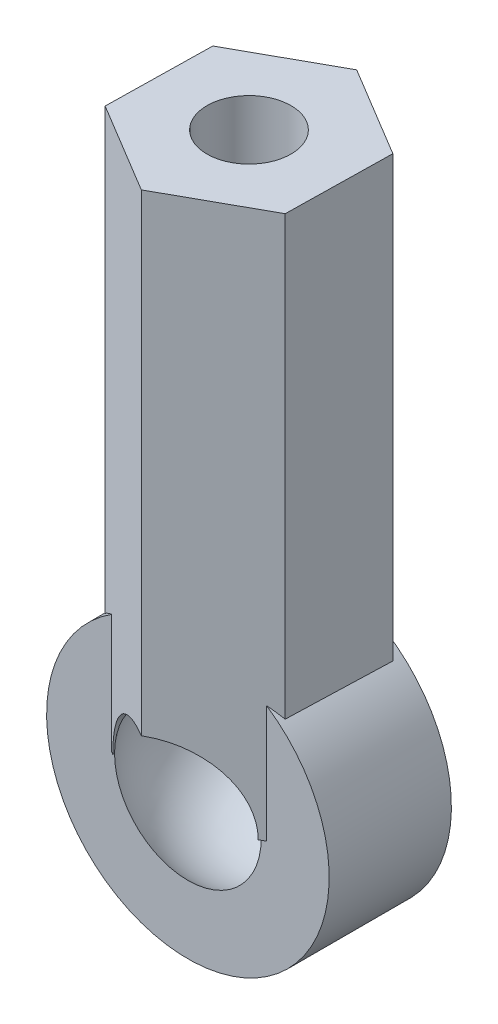
ISO-10303-21;
HEADER;
FILE_DESCRIPTION(('STEP AP214'),'2;1');
FILE_NAME('part.step','',(''),(''),'','','');
FILE_SCHEMA(('AUTOMOTIVE_DESIGN { 1 0 10303 214 1 1 1 1 }'));
ENDSEC;
DATA;
#1=APPLICATION_CONTEXT('core data for automotive mechanical design processes');
#2=APPLICATION_PROTOCOL_DEFINITION('international standard','automotive_design',2000,#1);
#3=PRODUCT_CONTEXT('',#1,'mechanical');
#4=PRODUCT('Part','Part','',(#3));
#5=PRODUCT_RELATED_PRODUCT_CATEGORY('part','',(#4));
#6=PRODUCT_DEFINITION_FORMATION('','',#4);
#7=PRODUCT_DEFINITION_CONTEXT('part definition',#1,'design');
#8=PRODUCT_DEFINITION('design','',#6,#7);
#9=PRODUCT_DEFINITION_SHAPE('','',#8);
#10=(LENGTH_UNIT() NAMED_UNIT(*) SI_UNIT(.MILLI.,.METRE.));
#11=(NAMED_UNIT(*) PLANE_ANGLE_UNIT() SI_UNIT($,.RADIAN.));
#12=(NAMED_UNIT(*) SI_UNIT($,.STERADIAN.) SOLID_ANGLE_UNIT());
#13=UNCERTAINTY_MEASURE_WITH_UNIT(LENGTH_MEASURE(1.E-05),#10,'distance_accuracy_value','');
#14=(GEOMETRIC_REPRESENTATION_CONTEXT(3) GLOBAL_UNCERTAINTY_ASSIGNED_CONTEXT((#13)) GLOBAL_UNIT_ASSIGNED_CONTEXT((#10,
#11,#12)) REPRESENTATION_CONTEXT('',''));
#15=CARTESIAN_POINT('',(0.,0.,0.));
#16=DIRECTION('',(0.,0.,1.));
#17=DIRECTION('',(1.,0.,0.));
#18=AXIS2_PLACEMENT_3D('',#15,#16,#17);
#19=CARTESIAN_POINT('',(0.,0.,0.));
#20=DIRECTION('',(0.,1.,0.));
#21=DIRECTION('',(0.,0.,1.));
#22=AXIS2_PLACEMENT_3D('',#19,#20,#21);
#23=PLANE('',#22);
#24=DIRECTION('',(-0.874675185978453,0.,0.48470952026297));
#25=VECTOR('',#24,1.);
#26=CARTESIAN_POINT('',(0.0486826411564219,0.,-2.77085365915453));
#27=LINE('',#26,#25);
#28=CARTESIAN_POINT('',(-1.92093727122985,0.,-1.67937017118387));
#29=VERTEX_POINT('',#28);
#30=CARTESIAN_POINT('',(-2.06416350537464,0.,-1.6));
#31=VERTEX_POINT('',#30);
#32=EDGE_CURVE('E246',#29,#31,#27,.T.);
#33=ORIENTED_EDGE('',*,*,#32,.F.);
#34=DIRECTION('',(0.,0.,-1.));
#35=VECTOR('',#34,1.);
#36=CARTESIAN_POINT('',(-1.92093727122985,0.,2.77085365915453));
#37=LINE('',#36,#35);
#38=CARTESIAN_POINT('',(-1.92093727122985,0.,-1.6));
#39=VERTEX_POINT('',#38);
#40=EDGE_CURVE('E273',#29,#39,#37,.F.);
#41=ORIENTED_EDGE('',*,*,#40,.T.);
#42=DIRECTION('',(-1.,0.,0.));
#43=VECTOR('',#42,1.);
#44=CARTESIAN_POINT('',(0.,0.,-1.6));
#45=LINE('',#44,#43);
#46=EDGE_CURVE('E171',#39,#31,#45,.T.);
#47=ORIENTED_EDGE('',*,*,#46,.T.);
#48=EDGE_LOOP('',(#33,#41,#47));
#49=FACE_BOUND('',#48,.T.);
#50=ADVANCED_FACE('F33',(#49),#23,.F.);
#51=CARTESIAN_POINT('',(1.99680530381448,0.,-1.6));
#52=VERTEX_POINT('',#51);
#53=CARTESIAN_POINT('',(1.92093727122985,0.,-1.6));
#54=VERTEX_POINT('',#53);
#55=EDGE_CURVE('E172',#52,#54,#45,.T.);
#56=ORIENTED_EDGE('',*,*,#55,.T.);
#57=DIRECTION('',(0.,0.,-1.));
#58=VECTOR('',#57,1.);
#59=CARTESIAN_POINT('',(1.92093727122985,0.,2.77085365915453));
#60=LINE('',#59,#58);
#61=CARTESIAN_POINT('',(1.92093727122985,0.,-1.6455979314174));
#62=VERTEX_POINT('',#61);
#63=EDGE_CURVE('E47',#54,#62,#60,.T.);
#64=ORIENTED_EDGE('',*,*,#63,.T.);
#65=DIRECTION('',(-0.857108350993127,0.,-0.515136170985733));
#66=VECTOR('',#65,1.);
#67=CARTESIAN_POINT('',(2.4239709795751,0.,-1.34326642561248));
#68=LINE('',#67,#66);
#69=EDGE_CURVE('E248',#52,#62,#68,.T.);
#70=ORIENTED_EDGE('',*,*,#69,.F.);
#71=EDGE_LOOP('',(#56,#64,#70));
#72=FACE_BOUND('',#71,.T.);
#73=ADVANCED_FACE('F297',(#72),#23,.F.);
#74=CARTESIAN_POINT('',(2.4239709795751,14.3,-1.34326642561248));
#75=DIRECTION('',(-0.515136170985733,0.,0.857108350993127));
#76=DIRECTION('',(0.857108350993127,0.,0.515136170985733));
#77=AXIS2_PLACEMENT_3D('',#74,#75,#76);
#78=PLANE('',#77);
#79=ORIENTED_EDGE('',*,*,#69,.T.);
#80=CARTESIAN_POINT('',(0.,0.,-2.80011272462709));
#81=DIRECTION('',(-0.515136170985733,0.,0.857108350993127));
#82=DIRECTION('',(-0.857108350993127,0.,-0.515136170985733));
#83=AXIS2_PLACEMENT_3D('',#80,#81,#82);
#84=ELLIPSE('',#83,2.24118370682548,1.92093727122985);
#85=CARTESIAN_POINT('',(0.0486826411564219,1.92032028590286,-2.77085365915453));
#86=VERTEX_POINT('',#85);
#87=EDGE_CURVE('E265',#62,#86,#84,.T.);
#88=ORIENTED_EDGE('',*,*,#87,.T.);
#89=DIRECTION('',(0.,-1.,0.));
#90=VECTOR('',#89,1.);
#91=CARTESIAN_POINT('',(0.0486826411564219,14.3,-2.77085365915453));
#92=LINE('',#91,#90);
#93=CARTESIAN_POINT('',(0.0486826411564219,14.3,-2.77085365915453));
#94=VERTEX_POINT('',#93);
#95=EDGE_CURVE('E168',#94,#86,#92,.T.);
#96=ORIENTED_EDGE('',*,*,#95,.F.);
#97=DIRECTION('',(-0.857108350993127,0.,-0.515136170985733));
#98=VECTOR('',#97,1.);
#99=CARTESIAN_POINT('',(2.4239709795751,14.3,-1.34326642561248));
#100=LINE('',#99,#98);
#101=CARTESIAN_POINT('',(2.4239709795751,14.3,-1.34326642561248));
#102=VERTEX_POINT('',#101);
#103=EDGE_CURVE('E240',#102,#94,#100,.T.);
#104=ORIENTED_EDGE('',*,*,#103,.F.);
#105=DIRECTION('',(0.,-1.,0.));
#106=VECTOR('',#105,1.);
#107=CARTESIAN_POINT('',(2.4239709795751,14.3,-1.34326642561248));
#108=LINE('',#107,#106);
#109=CARTESIAN_POINT('',(2.4239709795751,2.79541851789276,-1.34326642561248));
#110=VERTEX_POINT('',#109);
#111=EDGE_CURVE('E162',#102,#110,#108,.T.);
#112=ORIENTED_EDGE('',*,*,#111,.T.);
#113=CARTESIAN_POINT('',(0.,0.,-2.80011272462709));
#114=DIRECTION('',(-0.515136170985733,0.,0.857108350993127));
#115=DIRECTION('',(0.857108350993127,0.,0.515136170985733));
#116=AXIS2_PLACEMENT_3D('',#113,#114,#115);
#117=ELLIPSE('',#116,4.31684045046677,3.7);
#118=CARTESIAN_POINT('',(1.99680530381448,3.11492673728586,-1.6));
#119=VERTEX_POINT('',#118);
#120=EDGE_CURVE('E184',#119,#110,#117,.F.);
#121=ORIENTED_EDGE('',*,*,#120,.F.);
#122=DIRECTION('',(0.,-1.,0.));
#123=VECTOR('',#122,1.);
#124=CARTESIAN_POINT('',(1.99680530381448,0.,-1.6));
#125=LINE('',#124,#123);
#126=EDGE_CURVE('E205',#119,#52,#125,.T.);
#127=ORIENTED_EDGE('',*,*,#126,.T.);
#128=EDGE_LOOP('',(#79,#88,#96,#104,#112,#121,#127));
#129=FACE_BOUND('',#128,.T.);
#130=ADVANCED_FACE('F236',(#129),#78,.F.);
#131=CARTESIAN_POINT('',(0.0486826411564219,14.3,-2.77085365915453));
#132=DIRECTION('',(0.48470952026297,0.,0.874675185978453));
#133=DIRECTION('',(0.874675185978453,0.,-0.48470952026297));
#134=AXIS2_PLACEMENT_3D('',#131,#132,#133);
#135=PLANE('',#134);
#136=ORIENTED_EDGE('',*,*,#95,.T.);
#137=CARTESIAN_POINT('',(0.,0.,-2.74387571349157));
#138=DIRECTION('',(0.48470952026297,0.,0.874675185978453));
#139=DIRECTION('',(0.874675185978453,0.,-0.48470952026297));
#140=AXIS2_PLACEMENT_3D('',#137,#138,#139);
#141=ELLIPSE('',#140,2.19617213569515,1.92093727122985);
#142=EDGE_CURVE('E270',#86,#29,#141,.T.);
#143=ORIENTED_EDGE('',*,*,#142,.T.);
#144=ORIENTED_EDGE('',*,*,#32,.T.);
#145=DIRECTION('',(0.,1.,0.));
#146=VECTOR('',#145,1.);
#147=CARTESIAN_POINT('',(-2.06416350537464,0.,-1.6));
#148=LINE('',#147,#146);
#149=CARTESIAN_POINT('',(-2.06416350537464,3.07070497167661,-1.6));
#150=VERTEX_POINT('',#149);
#151=EDGE_CURVE('E203',#31,#150,#148,.T.);
#152=ORIENTED_EDGE('',*,*,#151,.T.);
#153=CARTESIAN_POINT('',(0.,0.,-2.74387571349157));
#154=DIRECTION('',(0.48470952026297,0.,0.874675185978453));
#155=DIRECTION('',(-0.874675185978453,0.,0.48470952026297));
#156=AXIS2_PLACEMENT_3D('',#153,#154,#155);
#157=ELLIPSE('',#156,4.23014172496617,3.7);
#158=CARTESIAN_POINT('',(-2.37528833841868,2.83690065200956,-1.42758723354205));
#159=VERTEX_POINT('',#158);
#160=EDGE_CURVE('E181',#159,#150,#157,.F.);
#161=ORIENTED_EDGE('',*,*,#160,.F.);
#162=DIRECTION('',(0.,-1.,0.));
#163=VECTOR('',#162,1.);
#164=CARTESIAN_POINT('',(-2.37528833841868,14.3,-1.42758723354205));
#165=LINE('',#164,#163);
#166=CARTESIAN_POINT('',(-2.37528833841868,14.3,-1.42758723354205));
#167=VERTEX_POINT('',#166);
#168=EDGE_CURVE('E159',#167,#159,#165,.T.);
#169=ORIENTED_EDGE('',*,*,#168,.F.);
#170=DIRECTION('',(-0.874675185978453,0.,0.48470952026297));
#171=VECTOR('',#170,1.);
#172=CARTESIAN_POINT('',(0.0486826411564219,14.3,-2.77085365915453));
#173=LINE('',#172,#171);
#174=EDGE_CURVE('E256',#94,#167,#173,.T.);
#175=ORIENTED_EDGE('',*,*,#174,.F.);
#176=EDGE_LOOP('',(#136,#143,#144,#152,#161,#169,#175));
#177=FACE_BOUND('',#176,.T.);
#178=ADVANCED_FACE('F286',(#177),#135,.F.);
#179=CARTESIAN_POINT('',(-2.4239709795751,14.3,1.34326642561248));
#180=DIRECTION('',(0.515136170985733,0.,-0.857108350993127));
#181=DIRECTION('',(-0.857108350993127,0.,-0.515136170985733));
#182=AXIS2_PLACEMENT_3D('',#179,#180,#181);
#183=PLANE('',#182);
#184=DIRECTION('',(0.857108350993127,0.,0.515136170985733));
#185=VECTOR('',#184,1.);
#186=CARTESIAN_POINT('',(-2.4239709795751,0.,1.34326642561248));
#187=LINE('',#186,#185);
#188=CARTESIAN_POINT('',(-1.99680530381448,0.,1.6));
#189=VERTEX_POINT('',#188);
#190=CARTESIAN_POINT('',(-1.92093727122985,0.,1.6455979314174));
#191=VERTEX_POINT('',#190);
#192=EDGE_CURVE('E150',#189,#191,#187,.T.);
#193=ORIENTED_EDGE('',*,*,#192,.T.);
#194=CARTESIAN_POINT('',(0.,0.,2.80011272462709));
#195=DIRECTION('',(0.515136170985733,0.,-0.857108350993127));
#196=DIRECTION('',(-0.857108350993127,0.,-0.515136170985733));
#197=AXIS2_PLACEMENT_3D('',#194,#195,#196);
#198=ELLIPSE('',#197,2.24118370682548,1.92093727122985);
#199=CARTESIAN_POINT('',(-0.048682641156421,1.92032028590286,2.77085365915453));
#200=VERTEX_POINT('',#199);
#201=EDGE_CURVE('E134',#191,#200,#198,.T.);
#202=ORIENTED_EDGE('',*,*,#201,.T.);
#203=DIRECTION('',(0.,-1.,0.));
#204=VECTOR('',#203,1.);
#205=CARTESIAN_POINT('',(-0.048682641156421,14.3,2.77085365915453));
#206=LINE('',#205,#204);
#207=CARTESIAN_POINT('',(-0.048682641156421,14.3,2.77085365915453));
#208=VERTEX_POINT('',#207);
#209=EDGE_CURVE('E146',#208,#200,#206,.T.);
#210=ORIENTED_EDGE('',*,*,#209,.F.);
#211=DIRECTION('',(0.857108350993127,0.,0.515136170985733));
#212=VECTOR('',#211,1.);
#213=CARTESIAN_POINT('',(-2.4239709795751,14.3,1.34326642561248));
#214=LINE('',#213,#212);
#215=CARTESIAN_POINT('',(-2.4239709795751,14.3,1.34326642561248));
#216=VERTEX_POINT('',#215);
#217=EDGE_CURVE('E252',#216,#208,#214,.T.);
#218=ORIENTED_EDGE('',*,*,#217,.F.);
#219=DIRECTION('',(0.,-1.,0.));
#220=VECTOR('',#219,1.);
#221=CARTESIAN_POINT('',(-2.4239709795751,14.3,1.34326642561248));
#222=LINE('',#221,#220);
#223=CARTESIAN_POINT('',(-2.4239709795751,2.79541851789276,1.34326642561248));
#224=VERTEX_POINT('',#223);
#225=EDGE_CURVE('E155',#216,#224,#222,.T.);
#226=ORIENTED_EDGE('',*,*,#225,.T.);
#227=CARTESIAN_POINT('',(0.,0.,2.80011272462709));
#228=DIRECTION('',(0.515136170985733,0.,-0.857108350993127));
#229=DIRECTION('',(0.857108350993127,0.,0.515136170985733));
#230=AXIS2_PLACEMENT_3D('',#227,#228,#229);
#231=ELLIPSE('',#230,4.31684045046677,3.7);
#232=CARTESIAN_POINT('',(-1.99680530381448,3.11492673728586,1.6));
#233=VERTEX_POINT('',#232);
#234=EDGE_CURVE('E178',#233,#224,#231,.F.);
#235=ORIENTED_EDGE('',*,*,#234,.F.);
#236=DIRECTION('',(0.,1.,0.));
#237=VECTOR('',#236,1.);
#238=CARTESIAN_POINT('',(-1.99680530381448,0.,1.6));
#239=LINE('',#238,#237);
#240=EDGE_CURVE('E200',#189,#233,#239,.T.);
#241=ORIENTED_EDGE('',*,*,#240,.F.);
#242=EDGE_LOOP('',(#193,#202,#210,#218,#226,#235,#241));
#243=FACE_BOUND('',#242,.T.);
#244=ADVANCED_FACE('F144',(#243),#183,.F.);
#245=CARTESIAN_POINT('',(-0.048682641156421,14.3,2.77085365915453));
#246=DIRECTION('',(-0.48470952026297,0.,-0.874675185978453));
#247=DIRECTION('',(-0.874675185978453,0.,0.48470952026297));
#248=AXIS2_PLACEMENT_3D('',#245,#246,#247);
#249=PLANE('',#248);
#250=ORIENTED_EDGE('',*,*,#209,.T.);
#251=CARTESIAN_POINT('',(0.,0.,2.74387571349157));
#252=DIRECTION('',(-0.48470952026297,0.,-0.874675185978453));
#253=DIRECTION('',(0.874675185978453,0.,-0.48470952026297));
#254=AXIS2_PLACEMENT_3D('',#251,#252,#253);
#255=ELLIPSE('',#254,2.19617213569515,1.92093727122985);
#256=CARTESIAN_POINT('',(1.92093727122985,0.,1.67937017118387));
#257=VERTEX_POINT('',#256);
#258=EDGE_CURVE('E131',#200,#257,#255,.T.);
#259=ORIENTED_EDGE('',*,*,#258,.T.);
#260=DIRECTION('',(0.874675185978453,0.,-0.48470952026297));
#261=VECTOR('',#260,1.);
#262=CARTESIAN_POINT('',(-0.048682641156421,0.,2.77085365915453));
#263=LINE('',#262,#261);
#264=CARTESIAN_POINT('',(2.06416350537465,0.,1.6));
#265=VERTEX_POINT('',#264);
#266=EDGE_CURVE('E220',#257,#265,#263,.T.);
#267=ORIENTED_EDGE('',*,*,#266,.T.);
#268=DIRECTION('',(0.,-1.,0.));
#269=VECTOR('',#268,1.);
#270=CARTESIAN_POINT('',(2.06416350537465,0.,1.6));
#271=LINE('',#270,#269);
#272=CARTESIAN_POINT('',(2.06416350537465,3.07070497167661,1.6));
#273=VERTEX_POINT('',#272);
#274=EDGE_CURVE('E197',#273,#265,#271,.T.);
#275=ORIENTED_EDGE('',*,*,#274,.F.);
#276=CARTESIAN_POINT('',(0.,0.,2.74387571349157));
#277=DIRECTION('',(-0.48470952026297,0.,-0.874675185978453));
#278=DIRECTION('',(-0.874675185978453,0.,0.48470952026297));
#279=AXIS2_PLACEMENT_3D('',#276,#277,#278);
#280=ELLIPSE('',#279,4.23014172496617,3.7);
#281=CARTESIAN_POINT('',(2.37528833841868,2.83690065200956,1.42758723354205));
#282=VERTEX_POINT('',#281);
#283=EDGE_CURVE('E175',#282,#273,#280,.F.);
#284=ORIENTED_EDGE('',*,*,#283,.F.);
#285=DIRECTION('',(0.,-1.,0.));
#286=VECTOR('',#285,1.);
#287=CARTESIAN_POINT('',(2.37528833841868,14.3,1.42758723354205));
#288=LINE('',#287,#286);
#289=CARTESIAN_POINT('',(2.37528833841868,14.3,1.42758723354205));
#290=VERTEX_POINT('',#289);
#291=EDGE_CURVE('E156',#290,#282,#288,.T.);
#292=ORIENTED_EDGE('',*,*,#291,.F.);
#293=DIRECTION('',(0.874675185978453,0.,-0.48470952026297));
#294=VECTOR('',#293,1.);
#295=CARTESIAN_POINT('',(-0.048682641156421,14.3,2.77085365915453));
#296=LINE('',#295,#294);
#297=EDGE_CURVE('E154',#208,#290,#296,.T.);
#298=ORIENTED_EDGE('',*,*,#297,.F.);
#299=EDGE_LOOP('',(#250,#259,#267,#275,#284,#292,#298));
#300=FACE_BOUND('',#299,.T.);
#301=ADVANCED_FACE('F152',(#300),#249,.F.);
#302=DIRECTION('',(-1.,0.,0.));
#303=VECTOR('',#302,1.);
#304=CARTESIAN_POINT('',(0.,0.,1.6));
#305=LINE('',#304,#303);
#306=CARTESIAN_POINT('',(-1.92093727122985,0.,1.6));
#307=VERTEX_POINT('',#306);
#308=EDGE_CURVE('E193',#307,#189,#305,.T.);
#309=ORIENTED_EDGE('',*,*,#308,.F.);
#310=DIRECTION('',(0.,0.,-1.));
#311=VECTOR('',#310,1.);
#312=CARTESIAN_POINT('',(-1.92093727122985,0.,2.77085365915453));
#313=LINE('',#312,#311);
#314=EDGE_CURVE('E55',#307,#191,#313,.F.);
#315=ORIENTED_EDGE('',*,*,#314,.T.);
#316=ORIENTED_EDGE('',*,*,#192,.F.);
#317=EDGE_LOOP('',(#309,#315,#316));
#318=FACE_BOUND('',#317,.T.);
#319=ADVANCED_FACE('F278',(#318),#23,.F.);
#320=ORIENTED_EDGE('',*,*,#266,.F.);
#321=DIRECTION('',(0.,0.,-1.));
#322=VECTOR('',#321,1.);
#323=CARTESIAN_POINT('',(1.92093727122985,0.,2.77085365915453));
#324=LINE('',#323,#322);
#325=CARTESIAN_POINT('',(1.92093727122985,0.,1.6));
#326=VERTEX_POINT('',#325);
#327=EDGE_CURVE('E136',#257,#326,#324,.T.);
#328=ORIENTED_EDGE('',*,*,#327,.T.);
#329=EDGE_CURVE('E194',#265,#326,#305,.T.);
#330=ORIENTED_EDGE('',*,*,#329,.F.);
#331=EDGE_LOOP('',(#320,#328,#330));
#332=FACE_BOUND('',#331,.T.);
#333=ADVANCED_FACE('F219',(#332),#23,.F.);
#334=CARTESIAN_POINT('',(0.,0.,-1.6));
#335=DIRECTION('',(0.,0.,1.));
#336=DIRECTION('',(1.,0.,0.));
#337=AXIS2_PLACEMENT_3D('',#334,#335,#336);
#338=PLANE('',#337);
#339=CARTESIAN_POINT('',(0.,0.,-1.6));
#340=DIRECTION('',(0.,0.,1.));
#341=DIRECTION('',(1.,0.,0.));
#342=AXIS2_PLACEMENT_3D('',#339,#340,#341);
#343=CIRCLE('',#342,1.92093727122985);
#344=EDGE_CURVE('E249',#54,#39,#343,.F.);
#345=ORIENTED_EDGE('',*,*,#344,.F.);
#346=ORIENTED_EDGE('',*,*,#55,.F.);
#347=ORIENTED_EDGE('',*,*,#126,.F.);
#348=CARTESIAN_POINT('',(0.,0.,-1.6));
#349=DIRECTION('',(0.,0.,1.));
#350=DIRECTION('',(1.,0.,0.));
#351=AXIS2_PLACEMENT_3D('',#348,#349,#350);
#352=CIRCLE('',#351,3.7);
#353=EDGE_CURVE('E190',#150,#119,#352,.T.);
#354=ORIENTED_EDGE('',*,*,#353,.F.);
#355=ORIENTED_EDGE('',*,*,#151,.F.);
#356=ORIENTED_EDGE('',*,*,#46,.F.);
#357=EDGE_LOOP('',(#345,#346,#347,#354,#355,#356));
#358=FACE_BOUND('',#357,.T.);
#359=ADVANCED_FACE('F293',(#358),#338,.F.);
#360=CARTESIAN_POINT('',(0.,0.,1.6));
#361=DIRECTION('',(0.,0.,1.));
#362=DIRECTION('',(1.,0.,0.));
#363=AXIS2_PLACEMENT_3D('',#360,#361,#362);
#364=PLANE('',#363);
#365=ORIENTED_EDGE('',*,*,#329,.T.);
#366=CARTESIAN_POINT('',(0.,0.,1.6));
#367=DIRECTION('',(0.,0.,1.));
#368=DIRECTION('',(1.,0.,0.));
#369=AXIS2_PLACEMENT_3D('',#366,#367,#368);
#370=CIRCLE('',#369,1.92093727122985);
#371=EDGE_CURVE('E213',#326,#307,#370,.F.);
#372=ORIENTED_EDGE('',*,*,#371,.T.);
#373=ORIENTED_EDGE('',*,*,#308,.T.);
#374=ORIENTED_EDGE('',*,*,#240,.T.);
#375=CARTESIAN_POINT('',(0.,0.,1.6));
#376=DIRECTION('',(0.,0.,1.));
#377=DIRECTION('',(1.,0.,0.));
#378=AXIS2_PLACEMENT_3D('',#375,#376,#377);
#379=CIRCLE('',#378,3.7);
#380=EDGE_CURVE('E187',#233,#273,#379,.T.);
#381=ORIENTED_EDGE('',*,*,#380,.T.);
#382=ORIENTED_EDGE('',*,*,#274,.T.);
#383=EDGE_LOOP('',(#365,#372,#373,#374,#381,#382));
#384=FACE_BOUND('',#383,.T.);
#385=ADVANCED_FACE('F225',(#384),#364,.T.);
#386=CARTESIAN_POINT('',(-2.37528833841868,14.3,-1.42758723354205));
#387=DIRECTION('',(0.999845691248704,0.,0.0175668349853257));
#388=DIRECTION('',(0.0175668349853257,0.,-0.999845691248704));
#389=AXIS2_PLACEMENT_3D('',#386,#387,#388);
#390=PLANE('',#389);
#391=CARTESIAN_POINT('',(0.,0.,-136.621081828618));
#392=DIRECTION('',(0.999845691248704,0.,0.0175668349853257));
#393=DIRECTION('',(-0.0175668349853257,0.,0.999845691248704));
#394=AXIS2_PLACEMENT_3D('',#391,#392,#393);
#395=ELLIPSE('',#394,210.624167819119,3.7);
#396=EDGE_CURVE('E210',#224,#159,#395,.F.);
#397=ORIENTED_EDGE('',*,*,#396,.F.);
#398=ORIENTED_EDGE('',*,*,#225,.F.);
#399=DIRECTION('',(-0.0175668349853257,0.,0.999845691248704));
#400=VECTOR('',#399,1.);
#401=CARTESIAN_POINT('',(-2.37528833841868,14.3,-1.42758723354205));
#402=LINE('',#401,#400);
#403=EDGE_CURVE('E254',#167,#216,#402,.T.);
#404=ORIENTED_EDGE('',*,*,#403,.F.);
#405=ORIENTED_EDGE('',*,*,#168,.T.);
#406=EDGE_LOOP('',(#397,#398,#404,#405));
#407=FACE_BOUND('',#406,.T.);
#408=ADVANCED_FACE('F282',(#407),#390,.F.);
#409=CARTESIAN_POINT('',(2.37528833841868,14.3,1.42758723354205));
#410=DIRECTION('',(-0.999845691248704,0.,-0.0175668349853258));
#411=DIRECTION('',(-0.0175668349853258,0.,0.999845691248704));
#412=AXIS2_PLACEMENT_3D('',#409,#410,#411);
#413=PLANE('',#412);
#414=CARTESIAN_POINT('',(0.,0.,136.621081828616));
#415=DIRECTION('',(-0.999845691248704,0.,-0.0175668349853258));
#416=DIRECTION('',(-0.0175668349853258,0.,0.999845691248704));
#417=AXIS2_PLACEMENT_3D('',#414,#415,#416);
#418=ELLIPSE('',#417,210.624167819117,3.7);
#419=EDGE_CURVE('E207',#110,#282,#418,.F.);
#420=ORIENTED_EDGE('',*,*,#419,.F.);
#421=ORIENTED_EDGE('',*,*,#111,.F.);
#422=DIRECTION('',(0.0175668349853258,0.,-0.999845691248704));
#423=VECTOR('',#422,1.);
#424=CARTESIAN_POINT('',(2.37528833841868,14.3,1.42758723354205));
#425=LINE('',#424,#423);
#426=EDGE_CURVE('E241',#290,#102,#425,.T.);
#427=ORIENTED_EDGE('',*,*,#426,.F.);
#428=ORIENTED_EDGE('',*,*,#291,.T.);
#429=EDGE_LOOP('',(#420,#421,#427,#428));
#430=FACE_BOUND('',#429,.T.);
#431=ADVANCED_FACE('F231',(#430),#413,.F.);
#432=CARTESIAN_POINT('',(0.,14.3,0.));
#433=DIRECTION('',(0.,1.,0.));
#434=DIRECTION('',(0.,0.,1.));
#435=AXIS2_PLACEMENT_3D('',#432,#433,#434);
#436=PLANE('',#435);
#437=CARTESIAN_POINT('',(0.,14.3,0.));
#438=DIRECTION('',(0.,1.,0.));
#439=DIRECTION('',(0.,0.,1.));
#440=AXIS2_PLACEMENT_3D('',#437,#438,#439);
#441=CIRCLE('',#440,1.1);
#442=CARTESIAN_POINT('',(0.,14.3,1.1));
#443=VERTEX_POINT('',#442);
#444=EDGE_CURVE('E262',#443,#443,#441,.T.);
#445=ORIENTED_EDGE('',*,*,#444,.F.);
#446=EDGE_LOOP('',(#445));
#447=FACE_BOUND('',#446,.T.);
#448=ORIENTED_EDGE('',*,*,#103,.T.);
#449=ORIENTED_EDGE('',*,*,#174,.T.);
#450=ORIENTED_EDGE('',*,*,#403,.T.);
#451=ORIENTED_EDGE('',*,*,#217,.T.);
#452=ORIENTED_EDGE('',*,*,#297,.T.);
#453=ORIENTED_EDGE('',*,*,#426,.T.);
#454=EDGE_LOOP('',(#448,#449,#450,#451,#452,#453));
#455=FACE_BOUND('',#454,.T.);
#456=ADVANCED_FACE('F344',(#447,#455),#436,.T.);
#457=CARTESIAN_POINT('',(0.,0.,-1.6));
#458=DIRECTION('',(0.,0.,1.));
#459=DIRECTION('',(1.,0.,0.));
#460=AXIS2_PLACEMENT_3D('',#457,#458,#459);
#461=CYLINDRICAL_SURFACE('',#460,3.7);
#462=ORIENTED_EDGE('',*,*,#396,.T.);
#463=ORIENTED_EDGE('',*,*,#160,.T.);
#464=ORIENTED_EDGE('',*,*,#353,.T.);
#465=ORIENTED_EDGE('',*,*,#120,.T.);
#466=ORIENTED_EDGE('',*,*,#419,.T.);
#467=ORIENTED_EDGE('',*,*,#283,.T.);
#468=ORIENTED_EDGE('',*,*,#380,.F.);
#469=ORIENTED_EDGE('',*,*,#234,.T.);
#470=EDGE_LOOP('',(#462,#463,#464,#465,#466,#467,#468,#469));
#471=FACE_BOUND('',#470,.T.);
#472=ADVANCED_FACE('F35',(#471),#461,.T.);
#473=CARTESIAN_POINT('',(0.,0.,0.));
#474=DIRECTION('',(0.,1.,0.));
#475=DIRECTION('',(1.,0.,0.));
#476=AXIS2_PLACEMENT_3D('',#473,#474,#475);
#477=SPHERICAL_SURFACE('',#476,2.5);
#478=CARTESIAN_POINT('',(0.,0.,0.));
#479=DIRECTION('',(0.,0.,1.));
#480=DIRECTION('',(1.,0.,0.));
#481=AXIS2_PLACEMENT_3D('',#478,#479,#480);
#482=SPHERICAL_SURFACE('',#481,2.5);
#483=CARTESIAN_POINT('',(0.,0.,-1.6));
#484=DIRECTION('',(0.,0.,1.));
#485=DIRECTION('',(1.,0.,0.));
#486=AXIS2_PLACEMENT_3D('',#483,#484,#485);
#487=CIRCLE('',#486,1.92093727122985);
#488=EDGE_CURVE('E11',#54,#39,#487,.T.);
#489=ORIENTED_EDGE('',*,*,#488,.F.);
#490=ORIENTED_EDGE('',*,*,#344,.T.);
#491=EDGE_LOOP('',(#489,#490));
#492=FACE_BOUND('',#491,.T.);
#493=CARTESIAN_POINT('',(0.,0.,1.6));
#494=DIRECTION('',(0.,0.,-1.));
#495=DIRECTION('',(-1.,0.,0.));
#496=AXIS2_PLACEMENT_3D('',#493,#494,#495);
#497=CIRCLE('',#496,1.92093727122985);
#498=EDGE_CURVE('E41',#307,#326,#497,.T.);
#499=ORIENTED_EDGE('',*,*,#498,.F.);
#500=ORIENTED_EDGE('',*,*,#371,.F.);
#501=EDGE_LOOP('',(#499,#500));
#502=FACE_BOUND('',#501,.T.);
#503=ADVANCED_FACE('F222',(#492,#502),#482,.F.);
#504=CARTESIAN_POINT('',(0.,9.3,0.));
#505=DIRECTION('',(0.,1.,0.));
#506=DIRECTION('',(0.,0.,1.));
#507=AXIS2_PLACEMENT_3D('',#504,#505,#506);
#508=CYLINDRICAL_SURFACE('',#507,1.1);
#509=CARTESIAN_POINT('',(0.,9.3,0.));
#510=DIRECTION('',(0.,1.,0.));
#511=DIRECTION('',(0.,0.,1.));
#512=AXIS2_PLACEMENT_3D('',#509,#510,#511);
#513=CIRCLE('',#512,1.1);
#514=CARTESIAN_POINT('',(0.,9.3,1.1));
#515=VERTEX_POINT('',#514);
#516=EDGE_CURVE('E261',#515,#515,#513,.T.);
#517=ORIENTED_EDGE('',*,*,#516,.F.);
#518=EDGE_LOOP('',(#517));
#519=FACE_BOUND('',#518,.T.);
#520=ORIENTED_EDGE('',*,*,#444,.T.);
#521=EDGE_LOOP('',(#520));
#522=FACE_BOUND('',#521,.T.);
#523=ADVANCED_FACE('F361',(#519,#522),#508,.F.);
#524=CARTESIAN_POINT('',(0.,9.3,0.));
#525=DIRECTION('',(0.,1.,0.));
#526=DIRECTION('',(0.,0.,1.));
#527=AXIS2_PLACEMENT_3D('',#524,#525,#526);
#528=PLANE('',#527);
#529=ORIENTED_EDGE('',*,*,#516,.T.);
#530=EDGE_LOOP('',(#529));
#531=FACE_BOUND('',#530,.T.);
#532=ADVANCED_FACE('F369',(#531),#528,.T.);
#533=CARTESIAN_POINT('',(0.,0.,2.77085365915453));
#534=DIRECTION('',(0.,0.,-1.));
#535=DIRECTION('',(-1.,0.,0.));
#536=AXIS2_PLACEMENT_3D('',#533,#534,#535);
#537=CYLINDRICAL_SURFACE('',#536,1.92093727122985);
#538=ORIENTED_EDGE('',*,*,#314,.F.);
#539=ORIENTED_EDGE('',*,*,#498,.T.);
#540=ORIENTED_EDGE('',*,*,#327,.F.);
#541=ORIENTED_EDGE('',*,*,#258,.F.);
#542=ORIENTED_EDGE('',*,*,#201,.F.);
#543=EDGE_LOOP('',(#538,#539,#540,#541,#542));
#544=FACE_BOUND('',#543,.T.);
#545=ADVANCED_FACE('F133',(#544),#537,.F.);
#546=ORIENTED_EDGE('',*,*,#63,.F.);
#547=ORIENTED_EDGE('',*,*,#488,.T.);
#548=ORIENTED_EDGE('',*,*,#40,.F.);
#549=ORIENTED_EDGE('',*,*,#142,.F.);
#550=ORIENTED_EDGE('',*,*,#87,.F.);
#551=EDGE_LOOP('',(#546,#547,#548,#549,#550));
#552=FACE_BOUND('',#551,.T.);
#553=ADVANCED_FACE('F384',(#552),#537,.F.);
#554=CLOSED_SHELL('',(#50,#73,#130,#178,#244,#301,#319,#333,#359,#385,#408,#431,#456,#472,#503,
#523,#532,#545,#553));
#555=MANIFOLD_SOLID_BREP('B2',#554);
#556=ADVANCED_BREP_SHAPE_REPRESENTATION('',(#18,#555),#14);
#557=SHAPE_DEFINITION_REPRESENTATION(#9,#556);
ENDSEC;
END-ISO-10303-21;
